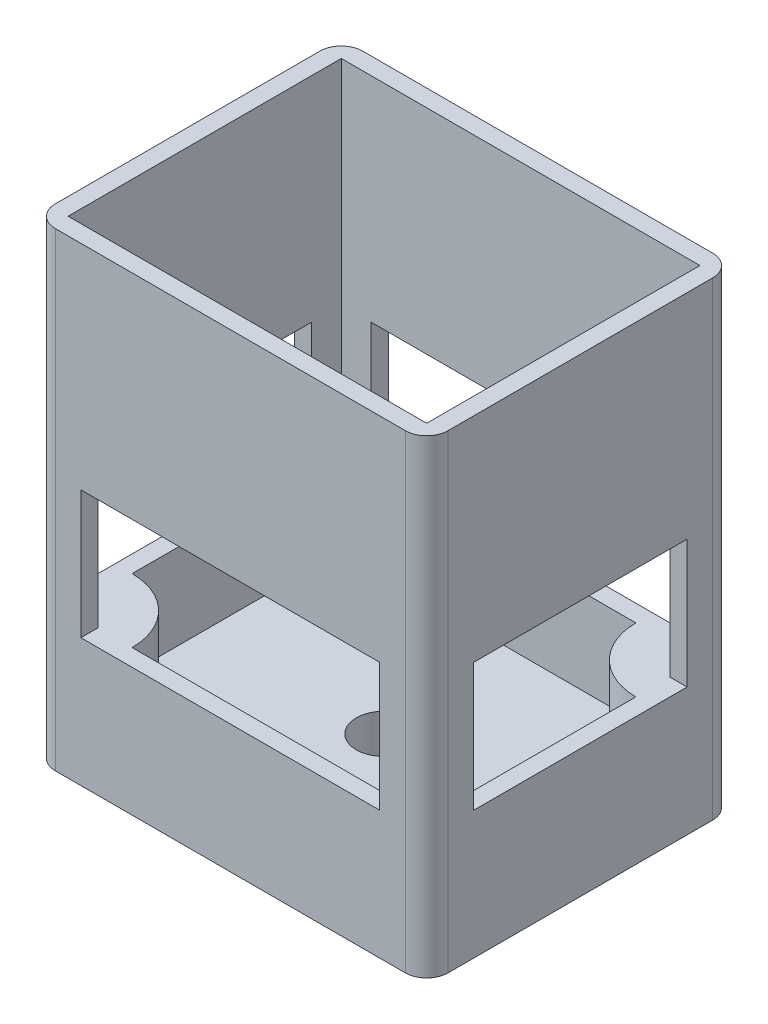
ISO-10303-21;
HEADER;
FILE_DESCRIPTION(('STEP AP214'),'2;1');
FILE_NAME('part.step','',(''),(''),'','','');
FILE_SCHEMA(('AUTOMOTIVE_DESIGN { 1 0 10303 214 1 1 1 1 }'));
ENDSEC;
DATA;
#1=APPLICATION_CONTEXT('core data for automotive mechanical design processes');
#2=APPLICATION_PROTOCOL_DEFINITION('international standard','automotive_design',2000,#1);
#3=PRODUCT_CONTEXT('',#1,'mechanical');
#4=PRODUCT('Part','Part','',(#3));
#5=PRODUCT_RELATED_PRODUCT_CATEGORY('part','',(#4));
#6=PRODUCT_DEFINITION_FORMATION('','',#4);
#7=PRODUCT_DEFINITION_CONTEXT('part definition',#1,'design');
#8=PRODUCT_DEFINITION('design','',#6,#7);
#9=PRODUCT_DEFINITION_SHAPE('','',#8);
#10=(LENGTH_UNIT() NAMED_UNIT(*) SI_UNIT(.MILLI.,.METRE.));
#11=(NAMED_UNIT(*) PLANE_ANGLE_UNIT() SI_UNIT($,.RADIAN.));
#12=(NAMED_UNIT(*) SI_UNIT($,.STERADIAN.) SOLID_ANGLE_UNIT());
#13=UNCERTAINTY_MEASURE_WITH_UNIT(LENGTH_MEASURE(1.E-05),#10,'distance_accuracy_value','');
#14=(GEOMETRIC_REPRESENTATION_CONTEXT(3) GLOBAL_UNCERTAINTY_ASSIGNED_CONTEXT((#13)) GLOBAL_UNIT_ASSIGNED_CONTEXT((#10,
#11,#12)) REPRESENTATION_CONTEXT('',''));
#15=CARTESIAN_POINT('',(0.,0.,0.));
#16=DIRECTION('',(0.,0.,1.));
#17=DIRECTION('',(1.,0.,0.));
#18=AXIS2_PLACEMENT_3D('',#15,#16,#17);
#19=CARTESIAN_POINT('',(21.,55.,-16.));
#20=DIRECTION('',(-1.,0.,0.));
#21=DIRECTION('',(0.,0.,1.));
#22=AXIS2_PLACEMENT_3D('',#19,#20,#21);
#23=PLANE('',#22);
#24=DIRECTION('',(0.,0.,-1.));
#25=VECTOR('',#24,1.);
#26=CARTESIAN_POINT('',(21.,15.,-8.5));
#27=LINE('',#26,#25);
#28=CARTESIAN_POINT('',(21.,15.,-12.5));
#29=VERTEX_POINT('',#28);
#30=CARTESIAN_POINT('',(21.,15.,-16.));
#31=VERTEX_POINT('',#30);
#32=EDGE_CURVE('E374',#29,#31,#27,.T.);
#33=ORIENTED_EDGE('',*,*,#32,.F.);
#34=DIRECTION('',(0.,1.,0.));
#35=VECTOR('',#34,1.);
#36=CARTESIAN_POINT('',(21.,55.,-12.5));
#37=LINE('',#36,#35);
#38=CARTESIAN_POINT('',(21.,30.,-12.5));
#39=VERTEX_POINT('',#38);
#40=EDGE_CURVE('E350',#29,#39,#37,.T.);
#41=ORIENTED_EDGE('',*,*,#40,.T.);
#42=DIRECTION('',(0.,0.,1.));
#43=VECTOR('',#42,1.);
#44=CARTESIAN_POINT('',(21.,30.,-16.));
#45=LINE('',#44,#43);
#46=CARTESIAN_POINT('',(21.,30.,12.5));
#47=VERTEX_POINT('',#46);
#48=EDGE_CURVE('E368',#39,#47,#45,.T.);
#49=ORIENTED_EDGE('',*,*,#48,.T.);
#50=DIRECTION('',(0.,-1.,0.));
#51=VECTOR('',#50,1.);
#52=CARTESIAN_POINT('',(21.,55.,12.5));
#53=LINE('',#52,#51);
#54=CARTESIAN_POINT('',(21.,15.,12.5));
#55=VERTEX_POINT('',#54);
#56=EDGE_CURVE('E362',#47,#55,#53,.T.);
#57=ORIENTED_EDGE('',*,*,#56,.T.);
#58=DIRECTION('',(0.,0.,-1.));
#59=VECTOR('',#58,1.);
#60=CARTESIAN_POINT('',(21.,15.,-16.));
#61=LINE('',#60,#59);
#62=CARTESIAN_POINT('',(21.,15.,-8.5));
#63=VERTEX_POINT('',#62);
#64=EDGE_CURVE('E354',#55,#63,#61,.T.);
#65=ORIENTED_EDGE('',*,*,#64,.T.);
#66=DIRECTION('',(0.,-1.,0.));
#67=VECTOR('',#66,1.);
#68=CARTESIAN_POINT('',(21.,15.,-8.5));
#69=LINE('',#68,#67);
#70=CARTESIAN_POINT('',(21.,5.,-8.5));
#71=VERTEX_POINT('',#70);
#72=EDGE_CURVE('E383',#63,#71,#69,.T.);
#73=ORIENTED_EDGE('',*,*,#72,.T.);
#74=DIRECTION('',(0.,0.,1.));
#75=VECTOR('',#74,1.);
#76=CARTESIAN_POINT('',(21.,5.,-16.));
#77=LINE('',#76,#75);
#78=CARTESIAN_POINT('',(21.,5.,16.));
#79=VERTEX_POINT('',#78);
#80=EDGE_CURVE('E404',#71,#79,#77,.T.);
#81=ORIENTED_EDGE('',*,*,#80,.T.);
#82=DIRECTION('',(0.,-1.,0.));
#83=VECTOR('',#82,1.);
#84=CARTESIAN_POINT('',(21.,55.,16.));
#85=LINE('',#84,#83);
#86=CARTESIAN_POINT('',(21.,55.,16.));
#87=VERTEX_POINT('',#86);
#88=EDGE_CURVE('E426',#87,#79,#85,.T.);
#89=ORIENTED_EDGE('',*,*,#88,.F.);
#90=DIRECTION('',(0.,0.,-1.));
#91=VECTOR('',#90,1.);
#92=CARTESIAN_POINT('',(21.,55.,-16.));
#93=LINE('',#92,#91);
#94=CARTESIAN_POINT('',(21.,55.,-16.));
#95=VERTEX_POINT('',#94);
#96=EDGE_CURVE('E415',#87,#95,#93,.T.);
#97=ORIENTED_EDGE('',*,*,#96,.T.);
#98=DIRECTION('',(0.,-1.,0.));
#99=VECTOR('',#98,1.);
#100=CARTESIAN_POINT('',(21.,55.,-16.));
#101=LINE('',#100,#99);
#102=EDGE_CURVE('E423',#95,#31,#101,.T.);
#103=ORIENTED_EDGE('',*,*,#102,.T.);
#104=EDGE_LOOP('',(#33,#41,#49,#57,#65,#73,#81,#89,#97,#103));
#105=FACE_BOUND('',#104,.T.);
#106=ADVANCED_FACE('F38',(#105),#23,.T.);
#107=CARTESIAN_POINT('',(-21.,55.,-16.));
#108=DIRECTION('',(1.,0.,0.));
#109=DIRECTION('',(0.,0.,-1.));
#110=AXIS2_PLACEMENT_3D('',#107,#108,#109);
#111=PLANE('',#110);
#112=DIRECTION('',(0.,-1.,0.));
#113=VECTOR('',#112,1.);
#114=CARTESIAN_POINT('',(-21.,55.,-12.5));
#115=LINE('',#114,#113);
#116=CARTESIAN_POINT('',(-21.,30.,-12.5));
#117=VERTEX_POINT('',#116);
#118=CARTESIAN_POINT('',(-21.,15.,-12.5));
#119=VERTEX_POINT('',#118);
#120=EDGE_CURVE('E347',#117,#119,#115,.T.);
#121=ORIENTED_EDGE('',*,*,#120,.T.);
#122=DIRECTION('',(0.,0.,1.));
#123=VECTOR('',#122,1.);
#124=CARTESIAN_POINT('',(-21.,15.,-16.));
#125=LINE('',#124,#123);
#126=CARTESIAN_POINT('',(-21.,15.,8.5));
#127=VERTEX_POINT('',#126);
#128=EDGE_CURVE('E353',#119,#127,#125,.T.);
#129=ORIENTED_EDGE('',*,*,#128,.T.);
#130=DIRECTION('',(0.,-1.,0.));
#131=VECTOR('',#130,1.);
#132=CARTESIAN_POINT('',(-21.,15.,8.5));
#133=LINE('',#132,#131);
#134=CARTESIAN_POINT('',(-21.,5.,8.5));
#135=VERTEX_POINT('',#134);
#136=EDGE_CURVE('E398',#127,#135,#133,.T.);
#137=ORIENTED_EDGE('',*,*,#136,.T.);
#138=DIRECTION('',(0.,0.,-1.));
#139=VECTOR('',#138,1.);
#140=CARTESIAN_POINT('',(-21.,5.,16.));
#141=LINE('',#140,#139);
#142=CARTESIAN_POINT('',(-21.,5.,-16.));
#143=VERTEX_POINT('',#142);
#144=EDGE_CURVE('E409',#135,#143,#141,.T.);
#145=ORIENTED_EDGE('',*,*,#144,.T.);
#146=DIRECTION('',(0.,-1.,0.));
#147=VECTOR('',#146,1.);
#148=CARTESIAN_POINT('',(-21.,55.,-16.));
#149=LINE('',#148,#147);
#150=CARTESIAN_POINT('',(-21.,55.,-16.));
#151=VERTEX_POINT('',#150);
#152=EDGE_CURVE('E420',#151,#143,#149,.T.);
#153=ORIENTED_EDGE('',*,*,#152,.F.);
#154=DIRECTION('',(0.,0.,1.));
#155=VECTOR('',#154,1.);
#156=CARTESIAN_POINT('',(-21.,55.,-16.));
#157=LINE('',#156,#155);
#158=CARTESIAN_POINT('',(-21.,55.,16.));
#159=VERTEX_POINT('',#158);
#160=EDGE_CURVE('E411',#151,#159,#157,.T.);
#161=ORIENTED_EDGE('',*,*,#160,.T.);
#162=DIRECTION('',(0.,-1.,0.));
#163=VECTOR('',#162,1.);
#164=CARTESIAN_POINT('',(-21.,55.,16.));
#165=LINE('',#164,#163);
#166=CARTESIAN_POINT('',(-21.,15.,16.));
#167=VERTEX_POINT('',#166);
#168=EDGE_CURVE('E429',#159,#167,#165,.T.);
#169=ORIENTED_EDGE('',*,*,#168,.T.);
#170=DIRECTION('',(0.,0.,1.));
#171=VECTOR('',#170,1.);
#172=CARTESIAN_POINT('',(-21.,15.,8.5));
#173=LINE('',#172,#171);
#174=CARTESIAN_POINT('',(-21.,15.,12.5));
#175=VERTEX_POINT('',#174);
#176=EDGE_CURVE('E388',#175,#167,#173,.T.);
#177=ORIENTED_EDGE('',*,*,#176,.F.);
#178=DIRECTION('',(0.,1.,0.));
#179=VECTOR('',#178,1.);
#180=CARTESIAN_POINT('',(-21.,55.,12.5));
#181=LINE('',#180,#179);
#182=CARTESIAN_POINT('',(-21.,30.,12.5));
#183=VERTEX_POINT('',#182);
#184=EDGE_CURVE('E357',#175,#183,#181,.T.);
#185=ORIENTED_EDGE('',*,*,#184,.T.);
#186=DIRECTION('',(0.,0.,-1.));
#187=VECTOR('',#186,1.);
#188=CARTESIAN_POINT('',(-21.,30.,-16.));
#189=LINE('',#188,#187);
#190=EDGE_CURVE('E365',#183,#117,#189,.T.);
#191=ORIENTED_EDGE('',*,*,#190,.T.);
#192=EDGE_LOOP('',(#121,#129,#137,#145,#153,#161,#169,#177,#185,#191));
#193=FACE_BOUND('',#192,.T.);
#194=ADVANCED_FACE('F537',(#193),#111,.T.);
#195=CARTESIAN_POINT('',(-23.,55.,-18.));
#196=DIRECTION('',(1.,0.,0.));
#197=DIRECTION('',(0.,0.,-1.));
#198=AXIS2_PLACEMENT_3D('',#195,#196,#197);
#199=PLANE('',#198);
#200=DIRECTION('',(0.,0.,1.));
#201=VECTOR('',#200,1.);
#202=CARTESIAN_POINT('',(-23.,55.,-18.));
#203=LINE('',#202,#201);
#204=CARTESIAN_POINT('',(-23.,55.,-15.5));
#205=VERTEX_POINT('',#204);
#206=CARTESIAN_POINT('',(-23.,55.,15.5));
#207=VERTEX_POINT('',#206);
#208=EDGE_CURVE('E433',#205,#207,#203,.T.);
#209=ORIENTED_EDGE('',*,*,#208,.F.);
#210=DIRECTION('',(0.,-1.,0.));
#211=VECTOR('',#210,1.);
#212=CARTESIAN_POINT('',(-23.,55.,-15.5));
#213=LINE('',#212,#211);
#214=CARTESIAN_POINT('',(-23.,0.,-15.5));
#215=VERTEX_POINT('',#214);
#216=EDGE_CURVE('E458',#205,#215,#213,.T.);
#217=ORIENTED_EDGE('',*,*,#216,.T.);
#218=DIRECTION('',(0.,0.,1.));
#219=VECTOR('',#218,1.);
#220=CARTESIAN_POINT('',(-23.,0.,-18.));
#221=LINE('',#220,#219);
#222=CARTESIAN_POINT('',(-23.,0.,15.5));
#223=VERTEX_POINT('',#222);
#224=EDGE_CURVE('E432',#215,#223,#221,.T.);
#225=ORIENTED_EDGE('',*,*,#224,.T.);
#226=DIRECTION('',(0.,-1.,0.));
#227=VECTOR('',#226,1.);
#228=CARTESIAN_POINT('',(-23.,55.,15.5));
#229=LINE('',#228,#227);
#230=EDGE_CURVE('E446',#223,#207,#229,.F.);
#231=ORIENTED_EDGE('',*,*,#230,.T.);
#232=EDGE_LOOP('',(#209,#217,#225,#231));
#233=FACE_BOUND('',#232,.T.);
#234=DIRECTION('',(0.,-1.,0.));
#235=VECTOR('',#234,1.);
#236=CARTESIAN_POINT('',(-23.,30.,-12.5));
#237=LINE('',#236,#235);
#238=CARTESIAN_POINT('',(-23.,30.,-12.5));
#239=VERTEX_POINT('',#238);
#240=CARTESIAN_POINT('',(-23.,15.,-12.5));
#241=VERTEX_POINT('',#240);
#242=EDGE_CURVE('E312',#239,#241,#237,.T.);
#243=ORIENTED_EDGE('',*,*,#242,.F.);
#244=DIRECTION('',(0.,0.,-1.));
#245=VECTOR('',#244,1.);
#246=CARTESIAN_POINT('',(-23.,30.,-12.5));
#247=LINE('',#246,#245);
#248=CARTESIAN_POINT('',(-23.,30.,12.5));
#249=VERTEX_POINT('',#248);
#250=EDGE_CURVE('E320',#249,#239,#247,.T.);
#251=ORIENTED_EDGE('',*,*,#250,.F.);
#252=DIRECTION('',(0.,1.,0.));
#253=VECTOR('',#252,1.);
#254=CARTESIAN_POINT('',(-23.,30.,12.5));
#255=LINE('',#254,#253);
#256=CARTESIAN_POINT('',(-23.,15.,12.5));
#257=VERTEX_POINT('',#256);
#258=EDGE_CURVE('E317',#257,#249,#255,.T.);
#259=ORIENTED_EDGE('',*,*,#258,.F.);
#260=DIRECTION('',(0.,0.,1.));
#261=VECTOR('',#260,1.);
#262=CARTESIAN_POINT('',(-23.,15.,-12.5));
#263=LINE('',#262,#261);
#264=EDGE_CURVE('E314',#241,#257,#263,.T.);
#265=ORIENTED_EDGE('',*,*,#264,.F.);
#266=EDGE_LOOP('',(#243,#251,#259,#265));
#267=FACE_BOUND('',#266,.T.);
#268=ADVANCED_FACE('F524',(#233,#267),#199,.F.);
#269=CARTESIAN_POINT('',(23.,55.,-18.));
#270=DIRECTION('',(-1.,0.,0.));
#271=DIRECTION('',(0.,0.,1.));
#272=AXIS2_PLACEMENT_3D('',#269,#270,#271);
#273=PLANE('',#272);
#274=DIRECTION('',(0.,0.,-1.));
#275=VECTOR('',#274,1.);
#276=CARTESIAN_POINT('',(23.,0.,-18.));
#277=LINE('',#276,#275);
#278=CARTESIAN_POINT('',(23.,0.,15.5));
#279=VERTEX_POINT('',#278);
#280=CARTESIAN_POINT('',(23.,0.,-15.5));
#281=VERTEX_POINT('',#280);
#282=EDGE_CURVE('E452',#279,#281,#277,.T.);
#283=ORIENTED_EDGE('',*,*,#282,.T.);
#284=DIRECTION('',(0.,-1.,0.));
#285=VECTOR('',#284,1.);
#286=CARTESIAN_POINT('',(23.,55.,-15.5));
#287=LINE('',#286,#285);
#288=CARTESIAN_POINT('',(23.,55.,-15.5));
#289=VERTEX_POINT('',#288);
#290=EDGE_CURVE('E485',#281,#289,#287,.F.);
#291=ORIENTED_EDGE('',*,*,#290,.T.);
#292=DIRECTION('',(0.,0.,-1.));
#293=VECTOR('',#292,1.);
#294=CARTESIAN_POINT('',(23.,55.,-18.));
#295=LINE('',#294,#293);
#296=CARTESIAN_POINT('',(23.,55.,15.5));
#297=VERTEX_POINT('',#296);
#298=EDGE_CURVE('E440',#297,#289,#295,.T.);
#299=ORIENTED_EDGE('',*,*,#298,.F.);
#300=DIRECTION('',(0.,-1.,0.));
#301=VECTOR('',#300,1.);
#302=CARTESIAN_POINT('',(23.,55.,15.5));
#303=LINE('',#302,#301);
#304=EDGE_CURVE('E482',#297,#279,#303,.T.);
#305=ORIENTED_EDGE('',*,*,#304,.T.);
#306=EDGE_LOOP('',(#283,#291,#299,#305));
#307=FACE_BOUND('',#306,.T.);
#308=DIRECTION('',(0.,-1.,0.));
#309=VECTOR('',#308,1.);
#310=CARTESIAN_POINT('',(23.,30.,-12.5));
#311=LINE('',#310,#309);
#312=CARTESIAN_POINT('',(23.,30.,-12.5));
#313=VERTEX_POINT('',#312);
#314=CARTESIAN_POINT('',(23.,15.,-12.5));
#315=VERTEX_POINT('',#314);
#316=EDGE_CURVE('E311',#313,#315,#311,.T.);
#317=ORIENTED_EDGE('',*,*,#316,.T.);
#318=DIRECTION('',(0.,0.,1.));
#319=VECTOR('',#318,1.);
#320=CARTESIAN_POINT('',(23.,15.,-12.5));
#321=LINE('',#320,#319);
#322=CARTESIAN_POINT('',(23.,15.,12.5));
#323=VERTEX_POINT('',#322);
#324=EDGE_CURVE('E325',#315,#323,#321,.T.);
#325=ORIENTED_EDGE('',*,*,#324,.T.);
#326=DIRECTION('',(0.,1.,0.));
#327=VECTOR('',#326,1.);
#328=CARTESIAN_POINT('',(23.,30.,12.5));
#329=LINE('',#328,#327);
#330=CARTESIAN_POINT('',(23.,30.,12.5));
#331=VERTEX_POINT('',#330);
#332=EDGE_CURVE('E328',#323,#331,#329,.T.);
#333=ORIENTED_EDGE('',*,*,#332,.T.);
#334=DIRECTION('',(0.,0.,-1.));
#335=VECTOR('',#334,1.);
#336=CARTESIAN_POINT('',(23.,30.,-12.5));
#337=LINE('',#336,#335);
#338=EDGE_CURVE('E315',#331,#313,#337,.T.);
#339=ORIENTED_EDGE('',*,*,#338,.T.);
#340=EDGE_LOOP('',(#317,#325,#333,#339));
#341=FACE_BOUND('',#340,.T.);
#342=ADVANCED_FACE('F505',(#307,#341),#273,.F.);
#343=CARTESIAN_POINT('',(0.,5.,0.));
#344=DIRECTION('',(0.,-1.,0.));
#345=DIRECTION('',(0.,0.,-1.));
#346=AXIS2_PLACEMENT_3D('',#343,#344,#345);
#347=PLANE('',#346);
#348=CARTESIAN_POINT('',(0.,5.,0.));
#349=DIRECTION('',(0.,1.,0.));
#350=DIRECTION('',(0.,0.,1.));
#351=AXIS2_PLACEMENT_3D('',#348,#349,#350);
#352=CIRCLE('',#351,3.25);
#353=CARTESIAN_POINT('',(0.,5.,3.25));
#354=VERTEX_POINT('',#353);
#355=EDGE_CURVE('E812',#354,#354,#352,.T.);
#356=ORIENTED_EDGE('',*,*,#355,.F.);
#357=EDGE_LOOP('',(#356));
#358=FACE_BOUND('',#357,.T.);
#359=CARTESIAN_POINT('',(21.,5.,-16.));
#360=DIRECTION('',(0.,1.,0.));
#361=DIRECTION('',(0.,0.,1.));
#362=AXIS2_PLACEMENT_3D('',#359,#360,#361);
#363=CIRCLE('',#362,7.5);
#364=CARTESIAN_POINT('',(13.5,5.,-16.));
#365=VERTEX_POINT('',#364);
#366=EDGE_CURVE('E371',#365,#71,#363,.T.);
#367=ORIENTED_EDGE('',*,*,#366,.F.);
#368=DIRECTION('',(1.,0.,0.));
#369=VECTOR('',#368,1.);
#370=CARTESIAN_POINT('',(-21.,5.,-16.));
#371=LINE('',#370,#369);
#372=EDGE_CURVE('E401',#143,#365,#371,.T.);
#373=ORIENTED_EDGE('',*,*,#372,.F.);
#374=ORIENTED_EDGE('',*,*,#144,.F.);
#375=CARTESIAN_POINT('',(-21.,5.,16.));
#376=DIRECTION('',(0.,1.,0.));
#377=DIRECTION('',(0.,0.,1.));
#378=AXIS2_PLACEMENT_3D('',#375,#376,#377);
#379=CIRCLE('',#378,7.5);
#380=CARTESIAN_POINT('',(-13.5,5.,16.));
#381=VERTEX_POINT('',#380);
#382=EDGE_CURVE('E385',#381,#135,#379,.T.);
#383=ORIENTED_EDGE('',*,*,#382,.F.);
#384=DIRECTION('',(-1.,0.,0.));
#385=VECTOR('',#384,1.);
#386=CARTESIAN_POINT('',(21.,5.,16.));
#387=LINE('',#386,#385);
#388=EDGE_CURVE('E406',#79,#381,#387,.T.);
#389=ORIENTED_EDGE('',*,*,#388,.F.);
#390=ORIENTED_EDGE('',*,*,#80,.F.);
#391=EDGE_LOOP('',(#367,#373,#374,#383,#389,#390));
#392=FACE_BOUND('',#391,.T.);
#393=ADVANCED_FACE('F563',(#358,#392),#347,.F.);
#394=CARTESIAN_POINT('',(-21.,55.,-16.));
#395=DIRECTION('',(0.,0.,1.));
#396=DIRECTION('',(1.,0.,0.));
#397=AXIS2_PLACEMENT_3D('',#394,#395,#396);
#398=PLANE('',#397);
#399=DIRECTION('',(0.,1.,0.));
#400=VECTOR('',#399,1.);
#401=CARTESIAN_POINT('',(17.5,55.,-16.));
#402=LINE('',#401,#400);
#403=CARTESIAN_POINT('',(17.5,15.,-16.));
#404=VERTEX_POINT('',#403);
#405=CARTESIAN_POINT('',(17.5,30.,-16.));
#406=VERTEX_POINT('',#405);
#407=EDGE_CURVE('E298',#404,#406,#402,.T.);
#408=ORIENTED_EDGE('',*,*,#407,.F.);
#409=DIRECTION('',(-1.,0.,0.));
#410=VECTOR('',#409,1.);
#411=CARTESIAN_POINT('',(21.,15.,-16.));
#412=LINE('',#411,#410);
#413=EDGE_CURVE('E376',#31,#404,#412,.T.);
#414=ORIENTED_EDGE('',*,*,#413,.F.);
#415=ORIENTED_EDGE('',*,*,#102,.F.);
#416=DIRECTION('',(-1.,0.,0.));
#417=VECTOR('',#416,1.);
#418=CARTESIAN_POINT('',(-21.,55.,-16.));
#419=LINE('',#418,#417);
#420=EDGE_CURVE('E418',#95,#151,#419,.T.);
#421=ORIENTED_EDGE('',*,*,#420,.T.);
#422=ORIENTED_EDGE('',*,*,#152,.T.);
#423=ORIENTED_EDGE('',*,*,#372,.T.);
#424=DIRECTION('',(0.,-1.,0.));
#425=VECTOR('',#424,1.);
#426=CARTESIAN_POINT('',(13.5,15.,-16.));
#427=LINE('',#426,#425);
#428=CARTESIAN_POINT('',(13.5,15.,-16.));
#429=VERTEX_POINT('',#428);
#430=EDGE_CURVE('E378',#429,#365,#427,.T.);
#431=ORIENTED_EDGE('',*,*,#430,.F.);
#432=DIRECTION('',(1.,0.,0.));
#433=VECTOR('',#432,1.);
#434=CARTESIAN_POINT('',(-21.,15.,-16.));
#435=LINE('',#434,#433);
#436=CARTESIAN_POINT('',(-17.5,15.,-16.));
#437=VERTEX_POINT('',#436);
#438=EDGE_CURVE('E301',#437,#429,#435,.T.);
#439=ORIENTED_EDGE('',*,*,#438,.F.);
#440=DIRECTION('',(0.,-1.,0.));
#441=VECTOR('',#440,1.);
#442=CARTESIAN_POINT('',(-17.5,55.,-16.));
#443=LINE('',#442,#441);
#444=CARTESIAN_POINT('',(-17.5,30.,-16.));
#445=VERTEX_POINT('',#444);
#446=EDGE_CURVE('E254',#445,#437,#443,.T.);
#447=ORIENTED_EDGE('',*,*,#446,.F.);
#448=DIRECTION('',(-1.,0.,0.));
#449=VECTOR('',#448,1.);
#450=CARTESIAN_POINT('',(-21.,30.,-16.));
#451=LINE('',#450,#449);
#452=EDGE_CURVE('E309',#406,#445,#451,.T.);
#453=ORIENTED_EDGE('',*,*,#452,.F.);
#454=EDGE_LOOP('',(#408,#414,#415,#421,#422,#423,#431,#439,#447,#453));
#455=FACE_BOUND('',#454,.T.);
#456=ADVANCED_FACE('F548',(#455),#398,.T.);
#457=CARTESIAN_POINT('',(-21.,55.,16.));
#458=DIRECTION('',(0.,0.,-1.));
#459=DIRECTION('',(-1.,0.,0.));
#460=AXIS2_PLACEMENT_3D('',#457,#458,#459);
#461=PLANE('',#460);
#462=DIRECTION('',(0.,1.,0.));
#463=VECTOR('',#462,1.);
#464=CARTESIAN_POINT('',(-17.5,55.,16.));
#465=LINE('',#464,#463);
#466=CARTESIAN_POINT('',(-17.5,15.,16.));
#467=VERTEX_POINT('',#466);
#468=CARTESIAN_POINT('',(-17.5,30.,16.));
#469=VERTEX_POINT('',#468);
#470=EDGE_CURVE('E303',#467,#469,#465,.T.);
#471=ORIENTED_EDGE('',*,*,#470,.F.);
#472=DIRECTION('',(1.,0.,0.));
#473=VECTOR('',#472,1.);
#474=CARTESIAN_POINT('',(-21.,15.,16.));
#475=LINE('',#474,#473);
#476=EDGE_CURVE('E390',#167,#467,#475,.T.);
#477=ORIENTED_EDGE('',*,*,#476,.F.);
#478=ORIENTED_EDGE('',*,*,#168,.F.);
#479=DIRECTION('',(1.,0.,0.));
#480=VECTOR('',#479,1.);
#481=CARTESIAN_POINT('',(-21.,55.,16.));
#482=LINE('',#481,#480);
#483=EDGE_CURVE('E413',#159,#87,#482,.T.);
#484=ORIENTED_EDGE('',*,*,#483,.T.);
#485=ORIENTED_EDGE('',*,*,#88,.T.);
#486=ORIENTED_EDGE('',*,*,#388,.T.);
#487=DIRECTION('',(0.,-1.,0.));
#488=VECTOR('',#487,1.);
#489=CARTESIAN_POINT('',(-13.5,15.,16.));
#490=LINE('',#489,#488);
#491=CARTESIAN_POINT('',(-13.5,15.,16.));
#492=VERTEX_POINT('',#491);
#493=EDGE_CURVE('E393',#492,#381,#490,.T.);
#494=ORIENTED_EDGE('',*,*,#493,.F.);
#495=DIRECTION('',(-1.,0.,0.));
#496=VECTOR('',#495,1.);
#497=CARTESIAN_POINT('',(-21.,15.,16.));
#498=LINE('',#497,#496);
#499=CARTESIAN_POINT('',(17.5,15.,16.));
#500=VERTEX_POINT('',#499);
#501=EDGE_CURVE('E300',#500,#492,#498,.T.);
#502=ORIENTED_EDGE('',*,*,#501,.F.);
#503=DIRECTION('',(0.,-1.,0.));
#504=VECTOR('',#503,1.);
#505=CARTESIAN_POINT('',(17.5,55.,16.));
#506=LINE('',#505,#504);
#507=CARTESIAN_POINT('',(17.5,30.,16.));
#508=VERTEX_POINT('',#507);
#509=EDGE_CURVE('E290',#508,#500,#506,.T.);
#510=ORIENTED_EDGE('',*,*,#509,.F.);
#511=DIRECTION('',(1.,0.,0.));
#512=VECTOR('',#511,1.);
#513=CARTESIAN_POINT('',(-21.,30.,16.));
#514=LINE('',#513,#512);
#515=EDGE_CURVE('E307',#469,#508,#514,.T.);
#516=ORIENTED_EDGE('',*,*,#515,.F.);
#517=EDGE_LOOP('',(#471,#477,#478,#484,#485,#486,#494,#502,#510,#516));
#518=FACE_BOUND('',#517,.T.);
#519=ADVANCED_FACE('F550',(#518),#461,.T.);
#520=CARTESIAN_POINT('',(0.,55.,0.));
#521=DIRECTION('',(0.,1.,0.));
#522=DIRECTION('',(0.,0.,1.));
#523=AXIS2_PLACEMENT_3D('',#520,#521,#522);
#524=PLANE('',#523);
#525=DIRECTION('',(-1.,0.,0.));
#526=VECTOR('',#525,1.);
#527=CARTESIAN_POINT('',(-23.,55.,-18.));
#528=LINE('',#527,#526);
#529=CARTESIAN_POINT('',(20.5,55.,-18.));
#530=VERTEX_POINT('',#529);
#531=CARTESIAN_POINT('',(-20.5,55.,-18.));
#532=VERTEX_POINT('',#531);
#533=EDGE_CURVE('E443',#530,#532,#528,.T.);
#534=ORIENTED_EDGE('',*,*,#533,.T.);
#535=CARTESIAN_POINT('',(-20.5,55.,-15.5));
#536=DIRECTION('',(0.,1.,0.));
#537=DIRECTION('',(0.,0.,1.));
#538=AXIS2_PLACEMENT_3D('',#535,#536,#537);
#539=CIRCLE('',#538,2.5);
#540=EDGE_CURVE('E480',#532,#205,#539,.T.);
#541=ORIENTED_EDGE('',*,*,#540,.T.);
#542=ORIENTED_EDGE('',*,*,#208,.T.);
#543=CARTESIAN_POINT('',(-20.5,55.,15.5));
#544=DIRECTION('',(0.,1.,0.));
#545=DIRECTION('',(0.,0.,1.));
#546=AXIS2_PLACEMENT_3D('',#543,#544,#545);
#547=CIRCLE('',#546,2.5);
#548=CARTESIAN_POINT('',(-20.5,55.,18.));
#549=VERTEX_POINT('',#548);
#550=EDGE_CURVE('E474',#207,#549,#547,.T.);
#551=ORIENTED_EDGE('',*,*,#550,.T.);
#552=DIRECTION('',(1.,0.,0.));
#553=VECTOR('',#552,1.);
#554=CARTESIAN_POINT('',(-23.,55.,18.));
#555=LINE('',#554,#553);
#556=CARTESIAN_POINT('',(20.5,55.,18.));
#557=VERTEX_POINT('',#556);
#558=EDGE_CURVE('E436',#549,#557,#555,.T.);
#559=ORIENTED_EDGE('',*,*,#558,.T.);
#560=CARTESIAN_POINT('',(20.5,55.,15.5));
#561=DIRECTION('',(0.,1.,0.));
#562=DIRECTION('',(0.,0.,1.));
#563=AXIS2_PLACEMENT_3D('',#560,#561,#562);
#564=CIRCLE('',#563,2.5);
#565=EDGE_CURVE('E476',#557,#297,#564,.T.);
#566=ORIENTED_EDGE('',*,*,#565,.T.);
#567=ORIENTED_EDGE('',*,*,#298,.T.);
#568=CARTESIAN_POINT('',(20.5,55.,-15.5));
#569=DIRECTION('',(0.,1.,0.));
#570=DIRECTION('',(0.,0.,1.));
#571=AXIS2_PLACEMENT_3D('',#568,#569,#570);
#572=CIRCLE('',#571,2.5);
#573=EDGE_CURVE('E478',#289,#530,#572,.T.);
#574=ORIENTED_EDGE('',*,*,#573,.T.);
#575=EDGE_LOOP('',(#534,#541,#542,#551,#559,#566,#567,#574));
#576=FACE_BOUND('',#575,.T.);
#577=ORIENTED_EDGE('',*,*,#483,.F.);
#578=ORIENTED_EDGE('',*,*,#160,.F.);
#579=ORIENTED_EDGE('',*,*,#420,.F.);
#580=ORIENTED_EDGE('',*,*,#96,.F.);
#581=EDGE_LOOP('',(#577,#578,#579,#580));
#582=FACE_BOUND('',#581,.T.);
#583=ADVANCED_FACE('F510',(#576,#582),#524,.T.);
#584=CARTESIAN_POINT('',(0.,0.,0.));
#585=DIRECTION('',(0.,1.,0.));
#586=DIRECTION('',(0.,0.,1.));
#587=AXIS2_PLACEMENT_3D('',#584,#585,#586);
#588=PLANE('',#587);
#589=CARTESIAN_POINT('',(0.,0.,0.));
#590=DIRECTION('',(0.,1.,0.));
#591=DIRECTION('',(0.,0.,1.));
#592=AXIS2_PLACEMENT_3D('',#589,#590,#591);
#593=CIRCLE('',#592,3.25);
#594=CARTESIAN_POINT('',(0.,0.,3.25));
#595=VERTEX_POINT('',#594);
#596=EDGE_CURVE('E277',#595,#595,#593,.F.);
#597=ORIENTED_EDGE('',*,*,#596,.F.);
#598=EDGE_LOOP('',(#597));
#599=FACE_BOUND('',#598,.T.);
#600=ORIENTED_EDGE('',*,*,#224,.F.);
#601=CARTESIAN_POINT('',(-20.5,0.,-15.5));
#602=DIRECTION('',(0.,1.,0.));
#603=DIRECTION('',(0.,0.,1.));
#604=AXIS2_PLACEMENT_3D('',#601,#602,#603);
#605=CIRCLE('',#604,2.5);
#606=CARTESIAN_POINT('',(-20.5,0.,-18.));
#607=VERTEX_POINT('',#606);
#608=EDGE_CURVE('E467',#215,#607,#605,.F.);
#609=ORIENTED_EDGE('',*,*,#608,.T.);
#610=DIRECTION('',(-1.,0.,0.));
#611=VECTOR('',#610,1.);
#612=CARTESIAN_POINT('',(-23.,0.,-18.));
#613=LINE('',#612,#611);
#614=CARTESIAN_POINT('',(20.5,0.,-18.));
#615=VERTEX_POINT('',#614);
#616=EDGE_CURVE('E437',#615,#607,#613,.T.);
#617=ORIENTED_EDGE('',*,*,#616,.F.);
#618=CARTESIAN_POINT('',(20.5,0.,-15.5));
#619=DIRECTION('',(0.,1.,0.));
#620=DIRECTION('',(0.,0.,1.));
#621=AXIS2_PLACEMENT_3D('',#618,#619,#620);
#622=CIRCLE('',#621,2.5);
#623=EDGE_CURVE('E465',#615,#281,#622,.F.);
#624=ORIENTED_EDGE('',*,*,#623,.T.);
#625=ORIENTED_EDGE('',*,*,#282,.F.);
#626=CARTESIAN_POINT('',(20.5,0.,15.5));
#627=DIRECTION('',(0.,1.,0.));
#628=DIRECTION('',(0.,0.,1.));
#629=AXIS2_PLACEMENT_3D('',#626,#627,#628);
#630=CIRCLE('',#629,2.5);
#631=CARTESIAN_POINT('',(20.5,0.,18.));
#632=VERTEX_POINT('',#631);
#633=EDGE_CURVE('E463',#279,#632,#630,.F.);
#634=ORIENTED_EDGE('',*,*,#633,.T.);
#635=DIRECTION('',(1.,0.,0.));
#636=VECTOR('',#635,1.);
#637=CARTESIAN_POINT('',(-23.,0.,18.));
#638=LINE('',#637,#636);
#639=CARTESIAN_POINT('',(-20.5,0.,18.));
#640=VERTEX_POINT('',#639);
#641=EDGE_CURVE('E449',#640,#632,#638,.T.);
#642=ORIENTED_EDGE('',*,*,#641,.F.);
#643=CARTESIAN_POINT('',(-20.5,0.,15.5));
#644=DIRECTION('',(0.,1.,0.));
#645=DIRECTION('',(0.,0.,1.));
#646=AXIS2_PLACEMENT_3D('',#643,#644,#645);
#647=CIRCLE('',#646,2.5);
#648=EDGE_CURVE('E461',#640,#223,#647,.F.);
#649=ORIENTED_EDGE('',*,*,#648,.T.);
#650=EDGE_LOOP('',(#600,#609,#617,#624,#625,#634,#642,#649));
#651=FACE_BOUND('',#650,.T.);
#652=ADVANCED_FACE('F497',(#599,#651),#588,.F.);
#653=CARTESIAN_POINT('',(-23.,55.,18.));
#654=DIRECTION('',(0.,0.,-1.));
#655=DIRECTION('',(-1.,0.,0.));
#656=AXIS2_PLACEMENT_3D('',#653,#654,#655);
#657=PLANE('',#656);
#658=DIRECTION('',(1.,0.,0.));
#659=VECTOR('',#658,1.);
#660=CARTESIAN_POINT('',(-17.5,15.,18.));
#661=LINE('',#660,#659);
#662=CARTESIAN_POINT('',(-17.5,15.,18.));
#663=VERTEX_POINT('',#662);
#664=CARTESIAN_POINT('',(17.5,15.,18.));
#665=VERTEX_POINT('',#664);
#666=EDGE_CURVE('E283',#663,#665,#661,.T.);
#667=ORIENTED_EDGE('',*,*,#666,.F.);
#668=DIRECTION('',(0.,-1.,0.));
#669=VECTOR('',#668,1.);
#670=CARTESIAN_POINT('',(-17.5,30.,18.));
#671=LINE('',#670,#669);
#672=CARTESIAN_POINT('',(-17.5,30.,18.));
#673=VERTEX_POINT('',#672);
#674=EDGE_CURVE('E53',#673,#663,#671,.T.);
#675=ORIENTED_EDGE('',*,*,#674,.F.);
#676=DIRECTION('',(-1.,0.,0.));
#677=VECTOR('',#676,1.);
#678=CARTESIAN_POINT('',(-17.5,30.,18.));
#679=LINE('',#678,#677);
#680=CARTESIAN_POINT('',(17.5,30.,18.));
#681=VERTEX_POINT('',#680);
#682=EDGE_CURVE('E271',#681,#673,#679,.T.);
#683=ORIENTED_EDGE('',*,*,#682,.F.);
#684=DIRECTION('',(0.,1.,0.));
#685=VECTOR('',#684,1.);
#686=CARTESIAN_POINT('',(17.5,30.,18.));
#687=LINE('',#686,#685);
#688=EDGE_CURVE('E274',#665,#681,#687,.T.);
#689=ORIENTED_EDGE('',*,*,#688,.F.);
#690=EDGE_LOOP('',(#667,#675,#683,#689));
#691=FACE_BOUND('',#690,.T.);
#692=ORIENTED_EDGE('',*,*,#641,.T.);
#693=DIRECTION('',(0.,-1.,0.));
#694=VECTOR('',#693,1.);
#695=CARTESIAN_POINT('',(20.5,55.,18.));
#696=LINE('',#695,#694);
#697=EDGE_CURVE('E11',#632,#557,#696,.F.);
#698=ORIENTED_EDGE('',*,*,#697,.T.);
#699=ORIENTED_EDGE('',*,*,#558,.F.);
#700=DIRECTION('',(0.,-1.,0.));
#701=VECTOR('',#700,1.);
#702=CARTESIAN_POINT('',(-20.5,55.,18.));
#703=LINE('',#702,#701);
#704=EDGE_CURVE('E46',#549,#640,#703,.T.);
#705=ORIENTED_EDGE('',*,*,#704,.T.);
#706=EDGE_LOOP('',(#692,#698,#699,#705));
#707=FACE_BOUND('',#706,.T.);
#708=ADVANCED_FACE('F491',(#691,#707),#657,.F.);
#709=CARTESIAN_POINT('',(-23.,55.,-18.));
#710=DIRECTION('',(0.,0.,1.));
#711=DIRECTION('',(1.,0.,0.));
#712=AXIS2_PLACEMENT_3D('',#709,#710,#711);
#713=PLANE('',#712);
#714=DIRECTION('',(-1.,0.,0.));
#715=VECTOR('',#714,1.);
#716=CARTESIAN_POINT('',(-17.5,30.,-18.));
#717=LINE('',#716,#715);
#718=CARTESIAN_POINT('',(17.5,30.,-18.));
#719=VERTEX_POINT('',#718);
#720=CARTESIAN_POINT('',(-17.5,30.,-18.));
#721=VERTEX_POINT('',#720);
#722=EDGE_CURVE('E270',#719,#721,#717,.T.);
#723=ORIENTED_EDGE('',*,*,#722,.T.);
#724=DIRECTION('',(0.,-1.,0.));
#725=VECTOR('',#724,1.);
#726=CARTESIAN_POINT('',(-17.5,30.,-18.));
#727=LINE('',#726,#725);
#728=CARTESIAN_POINT('',(-17.5,15.,-18.));
#729=VERTEX_POINT('',#728);
#730=EDGE_CURVE('E251',#721,#729,#727,.T.);
#731=ORIENTED_EDGE('',*,*,#730,.T.);
#732=DIRECTION('',(1.,0.,0.));
#733=VECTOR('',#732,1.);
#734=CARTESIAN_POINT('',(-17.5,15.,-18.));
#735=LINE('',#734,#733);
#736=CARTESIAN_POINT('',(17.5,15.,-18.));
#737=VERTEX_POINT('',#736);
#738=EDGE_CURVE('E261',#729,#737,#735,.T.);
#739=ORIENTED_EDGE('',*,*,#738,.T.);
#740=DIRECTION('',(0.,1.,0.));
#741=VECTOR('',#740,1.);
#742=CARTESIAN_POINT('',(17.5,30.,-18.));
#743=LINE('',#742,#741);
#744=EDGE_CURVE('E61',#737,#719,#743,.T.);
#745=ORIENTED_EDGE('',*,*,#744,.T.);
#746=EDGE_LOOP('',(#723,#731,#739,#745));
#747=FACE_BOUND('',#746,.T.);
#748=ORIENTED_EDGE('',*,*,#616,.T.);
#749=DIRECTION('',(0.,-1.,0.));
#750=VECTOR('',#749,1.);
#751=CARTESIAN_POINT('',(-20.5,55.,-18.));
#752=LINE('',#751,#750);
#753=EDGE_CURVE('E472',#607,#532,#752,.F.);
#754=ORIENTED_EDGE('',*,*,#753,.T.);
#755=ORIENTED_EDGE('',*,*,#533,.F.);
#756=DIRECTION('',(0.,-1.,0.));
#757=VECTOR('',#756,1.);
#758=CARTESIAN_POINT('',(20.5,55.,-18.));
#759=LINE('',#758,#757);
#760=EDGE_CURVE('E469',#530,#615,#759,.T.);
#761=ORIENTED_EDGE('',*,*,#760,.T.);
#762=EDGE_LOOP('',(#748,#754,#755,#761));
#763=FACE_BOUND('',#762,.T.);
#764=ADVANCED_FACE('F267',(#747,#763),#713,.F.);
#765=CARTESIAN_POINT('',(-20.5,55.,-15.5));
#766=DIRECTION('',(0.,-1.,0.));
#767=DIRECTION('',(0.,0.,-1.));
#768=AXIS2_PLACEMENT_3D('',#765,#766,#767);
#769=CYLINDRICAL_SURFACE('',#768,2.5);
#770=ORIENTED_EDGE('',*,*,#540,.F.);
#771=ORIENTED_EDGE('',*,*,#753,.F.);
#772=ORIENTED_EDGE('',*,*,#608,.F.);
#773=ORIENTED_EDGE('',*,*,#216,.F.);
#774=EDGE_LOOP('',(#770,#771,#772,#773));
#775=FACE_BOUND('',#774,.T.);
#776=ADVANCED_FACE('F521',(#775),#769,.T.);
#777=CARTESIAN_POINT('',(20.5,55.,-15.5));
#778=DIRECTION('',(0.,-1.,0.));
#779=DIRECTION('',(0.,0.,-1.));
#780=AXIS2_PLACEMENT_3D('',#777,#778,#779);
#781=CYLINDRICAL_SURFACE('',#780,2.5);
#782=ORIENTED_EDGE('',*,*,#573,.F.);
#783=ORIENTED_EDGE('',*,*,#290,.F.);
#784=ORIENTED_EDGE('',*,*,#623,.F.);
#785=ORIENTED_EDGE('',*,*,#760,.F.);
#786=EDGE_LOOP('',(#782,#783,#784,#785));
#787=FACE_BOUND('',#786,.T.);
#788=ADVANCED_FACE('F515',(#787),#781,.T.);
#789=CARTESIAN_POINT('',(20.5,55.,15.5));
#790=DIRECTION('',(0.,-1.,0.));
#791=DIRECTION('',(0.,0.,-1.));
#792=AXIS2_PLACEMENT_3D('',#789,#790,#791);
#793=CYLINDRICAL_SURFACE('',#792,2.5);
#794=ORIENTED_EDGE('',*,*,#565,.F.);
#795=ORIENTED_EDGE('',*,*,#697,.F.);
#796=ORIENTED_EDGE('',*,*,#633,.F.);
#797=ORIENTED_EDGE('',*,*,#304,.F.);
#798=EDGE_LOOP('',(#794,#795,#796,#797));
#799=FACE_BOUND('',#798,.T.);
#800=ADVANCED_FACE('F502',(#799),#793,.T.);
#801=CARTESIAN_POINT('',(-20.5,55.,15.5));
#802=DIRECTION('',(0.,-1.,0.));
#803=DIRECTION('',(0.,0.,-1.));
#804=AXIS2_PLACEMENT_3D('',#801,#802,#803);
#805=CYLINDRICAL_SURFACE('',#804,2.5);
#806=ORIENTED_EDGE('',*,*,#550,.F.);
#807=ORIENTED_EDGE('',*,*,#230,.F.);
#808=ORIENTED_EDGE('',*,*,#648,.F.);
#809=ORIENTED_EDGE('',*,*,#704,.F.);
#810=EDGE_LOOP('',(#806,#807,#808,#809));
#811=FACE_BOUND('',#810,.T.);
#812=ADVANCED_FACE('F40',(#811),#805,.T.);
#813=CARTESIAN_POINT('',(-21.,15.,16.));
#814=DIRECTION('',(0.,-1.,0.));
#815=DIRECTION('',(0.,0.,-1.));
#816=AXIS2_PLACEMENT_3D('',#813,#814,#815);
#817=CYLINDRICAL_SURFACE('',#816,7.5);
#818=ORIENTED_EDGE('',*,*,#382,.T.);
#819=ORIENTED_EDGE('',*,*,#136,.F.);
#820=CARTESIAN_POINT('',(-21.,15.,16.));
#821=DIRECTION('',(0.,1.,0.));
#822=DIRECTION('',(0.,0.,1.));
#823=AXIS2_PLACEMENT_3D('',#820,#821,#822);
#824=CIRCLE('',#823,7.5);
#825=EDGE_CURVE('E386',#492,#127,#824,.T.);
#826=ORIENTED_EDGE('',*,*,#825,.F.);
#827=ORIENTED_EDGE('',*,*,#493,.T.);
#828=EDGE_LOOP('',(#818,#819,#826,#827));
#829=FACE_BOUND('',#828,.T.);
#830=ADVANCED_FACE('F528',(#829),#817,.T.);
#831=CARTESIAN_POINT('',(-21.,15.,16.));
#832=DIRECTION('',(0.,1.,0.));
#833=DIRECTION('',(0.,0.,1.));
#834=AXIS2_PLACEMENT_3D('',#831,#832,#833);
#835=PLANE('',#834);
#836=ORIENTED_EDGE('',*,*,#476,.T.);
#837=DIRECTION('',(0.,0.,1.));
#838=VECTOR('',#837,1.);
#839=CARTESIAN_POINT('',(-17.5,15.,-18.));
#840=LINE('',#839,#838);
#841=EDGE_CURVE('E258',#467,#663,#840,.T.);
#842=ORIENTED_EDGE('',*,*,#841,.T.);
#843=ORIENTED_EDGE('',*,*,#666,.T.);
#844=DIRECTION('',(0.,0.,1.));
#845=VECTOR('',#844,1.);
#846=CARTESIAN_POINT('',(17.5,15.,-18.));
#847=LINE('',#846,#845);
#848=EDGE_CURVE('E257',#500,#665,#847,.T.);
#849=ORIENTED_EDGE('',*,*,#848,.F.);
#850=ORIENTED_EDGE('',*,*,#501,.T.);
#851=ORIENTED_EDGE('',*,*,#825,.T.);
#852=ORIENTED_EDGE('',*,*,#128,.F.);
#853=DIRECTION('',(1.,0.,0.));
#854=VECTOR('',#853,1.);
#855=CARTESIAN_POINT('',(-23.,15.,-12.5));
#856=LINE('',#855,#854);
#857=EDGE_CURVE('E344',#241,#119,#856,.T.);
#858=ORIENTED_EDGE('',*,*,#857,.F.);
#859=ORIENTED_EDGE('',*,*,#264,.T.);
#860=DIRECTION('',(1.,0.,0.));
#861=VECTOR('',#860,1.);
#862=CARTESIAN_POINT('',(-23.,15.,12.5));
#863=LINE('',#862,#861);
#864=EDGE_CURVE('E340',#257,#175,#863,.T.);
#865=ORIENTED_EDGE('',*,*,#864,.T.);
#866=ORIENTED_EDGE('',*,*,#176,.T.);
#867=EDGE_LOOP('',(#836,#842,#843,#849,#850,#851,#852,#858,#859,#865,#866));
#868=FACE_BOUND('',#867,.T.);
#869=ADVANCED_FACE('F533',(#868),#835,.T.);
#870=CARTESIAN_POINT('',(21.,15.,-16.));
#871=DIRECTION('',(0.,-1.,0.));
#872=DIRECTION('',(0.,0.,-1.));
#873=AXIS2_PLACEMENT_3D('',#870,#871,#872);
#874=CYLINDRICAL_SURFACE('',#873,7.5);
#875=ORIENTED_EDGE('',*,*,#366,.T.);
#876=ORIENTED_EDGE('',*,*,#72,.F.);
#877=CARTESIAN_POINT('',(21.,15.,-16.));
#878=DIRECTION('',(0.,1.,0.));
#879=DIRECTION('',(0.,0.,1.));
#880=AXIS2_PLACEMENT_3D('',#877,#878,#879);
#881=CIRCLE('',#880,7.5);
#882=EDGE_CURVE('E372',#429,#63,#881,.T.);
#883=ORIENTED_EDGE('',*,*,#882,.F.);
#884=ORIENTED_EDGE('',*,*,#430,.T.);
#885=EDGE_LOOP('',(#875,#876,#883,#884));
#886=FACE_BOUND('',#885,.T.);
#887=ADVANCED_FACE('F715',(#886),#874,.T.);
#888=CARTESIAN_POINT('',(21.,15.,-16.));
#889=DIRECTION('',(0.,1.,0.));
#890=DIRECTION('',(0.,0.,1.));
#891=AXIS2_PLACEMENT_3D('',#888,#889,#890);
#892=PLANE('',#891);
#893=ORIENTED_EDGE('',*,*,#413,.T.);
#894=EDGE_CURVE('E264',#737,#404,#847,.T.);
#895=ORIENTED_EDGE('',*,*,#894,.F.);
#896=ORIENTED_EDGE('',*,*,#738,.F.);
#897=EDGE_CURVE('E246',#729,#437,#840,.T.);
#898=ORIENTED_EDGE('',*,*,#897,.T.);
#899=ORIENTED_EDGE('',*,*,#438,.T.);
#900=ORIENTED_EDGE('',*,*,#882,.T.);
#901=ORIENTED_EDGE('',*,*,#64,.F.);
#902=EDGE_CURVE('E339',#55,#323,#863,.T.);
#903=ORIENTED_EDGE('',*,*,#902,.T.);
#904=ORIENTED_EDGE('',*,*,#324,.F.);
#905=EDGE_CURVE('E343',#29,#315,#856,.T.);
#906=ORIENTED_EDGE('',*,*,#905,.F.);
#907=ORIENTED_EDGE('',*,*,#32,.T.);
#908=EDGE_LOOP('',(#893,#895,#896,#898,#899,#900,#901,#903,#904,#906,#907));
#909=FACE_BOUND('',#908,.T.);
#910=ADVANCED_FACE('F263',(#909),#892,.T.);
#911=CARTESIAN_POINT('',(-23.,30.,-12.5));
#912=DIRECTION('',(0.,-1.,0.));
#913=DIRECTION('',(0.,0.,-1.));
#914=AXIS2_PLACEMENT_3D('',#911,#912,#913);
#915=PLANE('',#914);
#916=DIRECTION('',(1.,0.,0.));
#917=VECTOR('',#916,1.);
#918=CARTESIAN_POINT('',(-23.,30.,-12.5));
#919=LINE('',#918,#917);
#920=EDGE_CURVE('E322',#39,#313,#919,.T.);
#921=ORIENTED_EDGE('',*,*,#920,.T.);
#922=ORIENTED_EDGE('',*,*,#338,.F.);
#923=DIRECTION('',(1.,0.,0.));
#924=VECTOR('',#923,1.);
#925=CARTESIAN_POINT('',(-23.,30.,12.5));
#926=LINE('',#925,#924);
#927=EDGE_CURVE('E335',#47,#331,#926,.T.);
#928=ORIENTED_EDGE('',*,*,#927,.F.);
#929=ORIENTED_EDGE('',*,*,#48,.F.);
#930=EDGE_LOOP('',(#921,#922,#928,#929));
#931=FACE_BOUND('',#930,.T.);
#932=ADVANCED_FACE('F615',(#931),#915,.T.);
#933=CARTESIAN_POINT('',(-23.,30.,12.5));
#934=DIRECTION('',(0.,0.,-1.));
#935=DIRECTION('',(-1.,0.,0.));
#936=AXIS2_PLACEMENT_3D('',#933,#934,#935);
#937=PLANE('',#936);
#938=ORIENTED_EDGE('',*,*,#927,.T.);
#939=ORIENTED_EDGE('',*,*,#332,.F.);
#940=ORIENTED_EDGE('',*,*,#902,.F.);
#941=ORIENTED_EDGE('',*,*,#56,.F.);
#942=EDGE_LOOP('',(#938,#939,#940,#941));
#943=FACE_BOUND('',#942,.T.);
#944=ADVANCED_FACE('F620',(#943),#937,.T.);
#945=CARTESIAN_POINT('',(-23.,30.,-12.5));
#946=DIRECTION('',(0.,0.,1.));
#947=DIRECTION('',(0.,-1.,0.));
#948=AXIS2_PLACEMENT_3D('',#945,#946,#947);
#949=PLANE('',#948);
#950=ORIENTED_EDGE('',*,*,#905,.T.);
#951=ORIENTED_EDGE('',*,*,#316,.F.);
#952=ORIENTED_EDGE('',*,*,#920,.F.);
#953=ORIENTED_EDGE('',*,*,#40,.F.);
#954=EDGE_LOOP('',(#950,#951,#952,#953));
#955=FACE_BOUND('',#954,.T.);
#956=ADVANCED_FACE('F633',(#955),#949,.T.);
#957=EDGE_CURVE('E333',#239,#117,#919,.T.);
#958=ORIENTED_EDGE('',*,*,#957,.F.);
#959=ORIENTED_EDGE('',*,*,#242,.T.);
#960=ORIENTED_EDGE('',*,*,#857,.T.);
#961=ORIENTED_EDGE('',*,*,#120,.F.);
#962=EDGE_LOOP('',(#958,#959,#960,#961));
#963=FACE_BOUND('',#962,.T.);
#964=ADVANCED_FACE('F644',(#963),#949,.T.);
#965=ORIENTED_EDGE('',*,*,#864,.F.);
#966=ORIENTED_EDGE('',*,*,#258,.T.);
#967=EDGE_CURVE('E336',#249,#183,#926,.T.);
#968=ORIENTED_EDGE('',*,*,#967,.T.);
#969=ORIENTED_EDGE('',*,*,#184,.F.);
#970=EDGE_LOOP('',(#965,#966,#968,#969));
#971=FACE_BOUND('',#970,.T.);
#972=ADVANCED_FACE('F636',(#971),#937,.T.);
#973=ORIENTED_EDGE('',*,*,#967,.F.);
#974=ORIENTED_EDGE('',*,*,#250,.T.);
#975=ORIENTED_EDGE('',*,*,#957,.T.);
#976=ORIENTED_EDGE('',*,*,#190,.F.);
#977=EDGE_LOOP('',(#973,#974,#975,#976));
#978=FACE_BOUND('',#977,.T.);
#979=ADVANCED_FACE('F623',(#978),#915,.T.);
#980=CARTESIAN_POINT('',(17.5,30.,-18.));
#981=DIRECTION('',(1.,0.,0.));
#982=DIRECTION('',(0.,1.,0.));
#983=AXIS2_PLACEMENT_3D('',#980,#981,#982);
#984=PLANE('',#983);
#985=ORIENTED_EDGE('',*,*,#407,.T.);
#986=DIRECTION('',(0.,0.,1.));
#987=VECTOR('',#986,1.);
#988=CARTESIAN_POINT('',(17.5,30.,-18.));
#989=LINE('',#988,#987);
#990=EDGE_CURVE('E292',#719,#406,#989,.T.);
#991=ORIENTED_EDGE('',*,*,#990,.F.);
#992=ORIENTED_EDGE('',*,*,#744,.F.);
#993=ORIENTED_EDGE('',*,*,#894,.T.);
#994=EDGE_LOOP('',(#985,#991,#992,#993));
#995=FACE_BOUND('',#994,.T.);
#996=ADVANCED_FACE('F670',(#995),#984,.F.);
#997=CARTESIAN_POINT('',(-17.5,30.,-18.));
#998=DIRECTION('',(0.,1.,0.));
#999=DIRECTION('',(0.,0.,1.));
#1000=AXIS2_PLACEMENT_3D('',#997,#998,#999);
#1001=PLANE('',#1000);
#1002=ORIENTED_EDGE('',*,*,#452,.T.);
#1003=DIRECTION('',(0.,0.,1.));
#1004=VECTOR('',#1003,1.);
#1005=CARTESIAN_POINT('',(-17.5,30.,-18.));
#1006=LINE('',#1005,#1004);
#1007=EDGE_CURVE('E288',#721,#445,#1006,.T.);
#1008=ORIENTED_EDGE('',*,*,#1007,.F.);
#1009=ORIENTED_EDGE('',*,*,#722,.F.);
#1010=ORIENTED_EDGE('',*,*,#990,.T.);
#1011=EDGE_LOOP('',(#1002,#1008,#1009,#1010));
#1012=FACE_BOUND('',#1011,.T.);
#1013=ADVANCED_FACE('F740',(#1012),#1001,.F.);
#1014=CARTESIAN_POINT('',(-17.5,30.,-18.));
#1015=DIRECTION('',(-1.,0.,0.));
#1016=DIRECTION('',(0.,-1.,0.));
#1017=AXIS2_PLACEMENT_3D('',#1014,#1015,#1016);
#1018=PLANE('',#1017);
#1019=ORIENTED_EDGE('',*,*,#446,.T.);
#1020=ORIENTED_EDGE('',*,*,#897,.F.);
#1021=ORIENTED_EDGE('',*,*,#730,.F.);
#1022=ORIENTED_EDGE('',*,*,#1007,.T.);
#1023=EDGE_LOOP('',(#1019,#1020,#1021,#1022));
#1024=FACE_BOUND('',#1023,.T.);
#1025=ADVANCED_FACE('F248',(#1024),#1018,.F.);
#1026=ORIENTED_EDGE('',*,*,#470,.T.);
#1027=EDGE_CURVE('E291',#469,#673,#1006,.T.);
#1028=ORIENTED_EDGE('',*,*,#1027,.T.);
#1029=ORIENTED_EDGE('',*,*,#674,.T.);
#1030=ORIENTED_EDGE('',*,*,#841,.F.);
#1031=EDGE_LOOP('',(#1026,#1028,#1029,#1030));
#1032=FACE_BOUND('',#1031,.T.);
#1033=ADVANCED_FACE('F760',(#1032),#1018,.F.);
#1034=ORIENTED_EDGE('',*,*,#515,.T.);
#1035=EDGE_CURVE('E295',#508,#681,#989,.T.);
#1036=ORIENTED_EDGE('',*,*,#1035,.T.);
#1037=ORIENTED_EDGE('',*,*,#682,.T.);
#1038=ORIENTED_EDGE('',*,*,#1027,.F.);
#1039=EDGE_LOOP('',(#1034,#1036,#1037,#1038));
#1040=FACE_BOUND('',#1039,.T.);
#1041=ADVANCED_FACE('F752',(#1040),#1001,.F.);
#1042=ORIENTED_EDGE('',*,*,#509,.T.);
#1043=ORIENTED_EDGE('',*,*,#848,.T.);
#1044=ORIENTED_EDGE('',*,*,#688,.T.);
#1045=ORIENTED_EDGE('',*,*,#1035,.F.);
#1046=EDGE_LOOP('',(#1042,#1043,#1044,#1045));
#1047=FACE_BOUND('',#1046,.T.);
#1048=ADVANCED_FACE('F742',(#1047),#984,.F.);
#1049=CARTESIAN_POINT('',(0.,-0.00100000000000013,0.));
#1050=DIRECTION('',(0.,1.,0.));
#1051=DIRECTION('',(0.,0.,1.));
#1052=AXIS2_PLACEMENT_3D('',#1049,#1050,#1051);
#1053=CYLINDRICAL_SURFACE('',#1052,3.25);
#1054=ORIENTED_EDGE('',*,*,#355,.T.);
#1055=EDGE_LOOP('',(#1054));
#1056=FACE_BOUND('',#1055,.T.);
#1057=ORIENTED_EDGE('',*,*,#596,.T.);
#1058=EDGE_LOOP('',(#1057));
#1059=FACE_BOUND('',#1058,.T.);
#1060=ADVANCED_FACE('F784',(#1056,#1059),#1053,.F.);
#1061=CLOSED_SHELL('',(#106,#194,#268,#342,#393,#456,#519,#583,#652,#708,#764,#776,#788,#800,
#812,#830,#869,#887,#910,#932,#944,#956,#964,#972,#979,#996,#1013,#1025,#1033,#1041,#1048,#1060));
#1062=MANIFOLD_SOLID_BREP('B2',#1061);
#1063=ADVANCED_BREP_SHAPE_REPRESENTATION('',(#18,#1062),#14);
#1064=SHAPE_DEFINITION_REPRESENTATION(#9,#1063);
ENDSEC;
END-ISO-10303-21;
